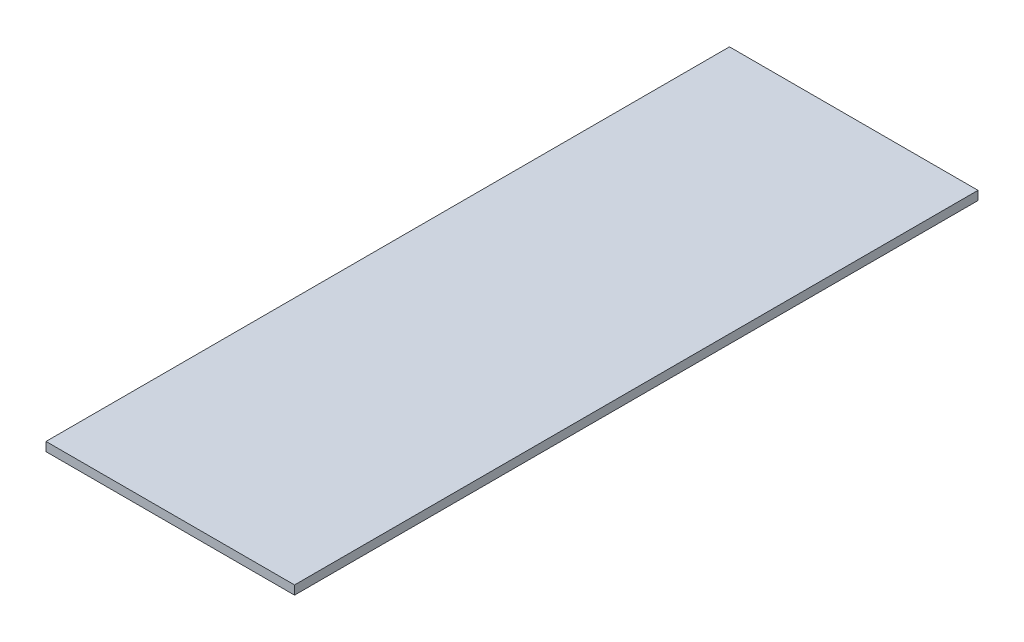
ISO-10303-21;
HEADER;
FILE_DESCRIPTION(('STEP AP214'),'2;1');
FILE_NAME('part.step','',(''),(''),'','','');
FILE_SCHEMA(('AUTOMOTIVE_DESIGN { 1 0 10303 214 1 1 1 1 }'));
ENDSEC;
DATA;
#1=APPLICATION_CONTEXT('core data for automotive mechanical design processes');
#2=APPLICATION_PROTOCOL_DEFINITION('international standard','automotive_design',2000,#1);
#3=PRODUCT_CONTEXT('',#1,'mechanical');
#4=PRODUCT('Part','Part','',(#3));
#5=PRODUCT_RELATED_PRODUCT_CATEGORY('part','',(#4));
#6=PRODUCT_DEFINITION_FORMATION('','',#4);
#7=PRODUCT_DEFINITION_CONTEXT('part definition',#1,'design');
#8=PRODUCT_DEFINITION('design','',#6,#7);
#9=PRODUCT_DEFINITION_SHAPE('','',#8);
#10=(LENGTH_UNIT() NAMED_UNIT(*) SI_UNIT(.MILLI.,.METRE.));
#11=(NAMED_UNIT(*) PLANE_ANGLE_UNIT() SI_UNIT($,.RADIAN.));
#12=(NAMED_UNIT(*) SI_UNIT($,.STERADIAN.) SOLID_ANGLE_UNIT());
#13=UNCERTAINTY_MEASURE_WITH_UNIT(LENGTH_MEASURE(1.E-05),#10,'distance_accuracy_value','');
#14=(GEOMETRIC_REPRESENTATION_CONTEXT(3) GLOBAL_UNCERTAINTY_ASSIGNED_CONTEXT((#13)) GLOBAL_UNIT_ASSIGNED_CONTEXT((#10,
#11,#12)) REPRESENTATION_CONTEXT('',''));
#15=CARTESIAN_POINT('',(0.,0.,0.));
#16=DIRECTION('',(0.,0.,1.));
#17=DIRECTION('',(1.,0.,0.));
#18=AXIS2_PLACEMENT_3D('',#15,#16,#17);
#19=CARTESIAN_POINT('',(-28.,2.,77.));
#20=DIRECTION('',(0.,0.,-1.));
#21=DIRECTION('',(-1.,0.,0.));
#22=AXIS2_PLACEMENT_3D('',#19,#20,#21);
#23=PLANE('',#22);
#24=DIRECTION('',(1.,0.,0.));
#25=VECTOR('',#24,1.);
#26=CARTESIAN_POINT('',(-28.,0.,77.));
#27=LINE('',#26,#25);
#28=CARTESIAN_POINT('',(-28.,0.,77.));
#29=VERTEX_POINT('',#28);
#30=CARTESIAN_POINT('',(28.,0.,77.));
#31=VERTEX_POINT('',#30);
#32=EDGE_CURVE('E98',#29,#31,#27,.T.);
#33=ORIENTED_EDGE('',*,*,#32,.T.);
#34=DIRECTION('',(0.,-1.,0.));
#35=VECTOR('',#34,1.);
#36=CARTESIAN_POINT('',(28.,2.,77.));
#37=LINE('',#36,#35);
#38=CARTESIAN_POINT('',(28.,2.,77.));
#39=VERTEX_POINT('',#38);
#40=EDGE_CURVE('E11',#39,#31,#37,.T.);
#41=ORIENTED_EDGE('',*,*,#40,.F.);
#42=DIRECTION('',(1.,0.,0.));
#43=VECTOR('',#42,1.);
#44=CARTESIAN_POINT('',(-28.,2.,77.));
#45=LINE('',#44,#43);
#46=CARTESIAN_POINT('',(-28.,2.,77.));
#47=VERTEX_POINT('',#46);
#48=EDGE_CURVE('E86',#47,#39,#45,.T.);
#49=ORIENTED_EDGE('',*,*,#48,.F.);
#50=DIRECTION('',(0.,-1.,0.));
#51=VECTOR('',#50,1.);
#52=CARTESIAN_POINT('',(-28.,2.,77.));
#53=LINE('',#52,#51);
#54=EDGE_CURVE('E94',#47,#29,#53,.T.);
#55=ORIENTED_EDGE('',*,*,#54,.T.);
#56=EDGE_LOOP('',(#33,#41,#49,#55));
#57=FACE_BOUND('',#56,.T.);
#58=ADVANCED_FACE('F35',(#57),#23,.F.);
#59=CARTESIAN_POINT('',(28.,2.,77.));
#60=DIRECTION('',(-1.,0.,0.));
#61=DIRECTION('',(0.,0.,1.));
#62=AXIS2_PLACEMENT_3D('',#59,#60,#61);
#63=PLANE('',#62);
#64=DIRECTION('',(0.,0.,-1.));
#65=VECTOR('',#64,1.);
#66=CARTESIAN_POINT('',(28.,0.,77.));
#67=LINE('',#66,#65);
#68=CARTESIAN_POINT('',(28.,0.,-77.));
#69=VERTEX_POINT('',#68);
#70=EDGE_CURVE('E90',#31,#69,#67,.T.);
#71=ORIENTED_EDGE('',*,*,#70,.T.);
#72=DIRECTION('',(0.,-1.,0.));
#73=VECTOR('',#72,1.);
#74=CARTESIAN_POINT('',(28.,2.,-77.));
#75=LINE('',#74,#73);
#76=CARTESIAN_POINT('',(28.,2.,-77.));
#77=VERTEX_POINT('',#76);
#78=EDGE_CURVE('E43',#77,#69,#75,.T.);
#79=ORIENTED_EDGE('',*,*,#78,.F.);
#80=DIRECTION('',(0.,0.,-1.));
#81=VECTOR('',#80,1.);
#82=CARTESIAN_POINT('',(28.,2.,77.));
#83=LINE('',#82,#81);
#84=EDGE_CURVE('E81',#39,#77,#83,.T.);
#85=ORIENTED_EDGE('',*,*,#84,.F.);
#86=ORIENTED_EDGE('',*,*,#40,.T.);
#87=EDGE_LOOP('',(#71,#79,#85,#86));
#88=FACE_BOUND('',#87,.T.);
#89=ADVANCED_FACE('F89',(#88),#63,.F.);
#90=CARTESIAN_POINT('',(-28.,2.,-77.));
#91=DIRECTION('',(0.,0.,1.));
#92=DIRECTION('',(1.,0.,0.));
#93=AXIS2_PLACEMENT_3D('',#90,#91,#92);
#94=PLANE('',#93);
#95=DIRECTION('',(-1.,0.,0.));
#96=VECTOR('',#95,1.);
#97=CARTESIAN_POINT('',(-28.,0.,-77.));
#98=LINE('',#97,#96);
#99=CARTESIAN_POINT('',(-28.,0.,-77.));
#100=VERTEX_POINT('',#99);
#101=EDGE_CURVE('E68',#69,#100,#98,.T.);
#102=ORIENTED_EDGE('',*,*,#101,.T.);
#103=DIRECTION('',(0.,-1.,0.));
#104=VECTOR('',#103,1.);
#105=CARTESIAN_POINT('',(-28.,2.,-77.));
#106=LINE('',#105,#104);
#107=CARTESIAN_POINT('',(-28.,2.,-77.));
#108=VERTEX_POINT('',#107);
#109=EDGE_CURVE('E91',#108,#100,#106,.T.);
#110=ORIENTED_EDGE('',*,*,#109,.F.);
#111=DIRECTION('',(-1.,0.,0.));
#112=VECTOR('',#111,1.);
#113=CARTESIAN_POINT('',(-28.,2.,-77.));
#114=LINE('',#113,#112);
#115=EDGE_CURVE('E84',#77,#108,#114,.T.);
#116=ORIENTED_EDGE('',*,*,#115,.F.);
#117=ORIENTED_EDGE('',*,*,#78,.T.);
#118=EDGE_LOOP('',(#102,#110,#116,#117));
#119=FACE_BOUND('',#118,.T.);
#120=ADVANCED_FACE('F92',(#119),#94,.F.);
#121=CARTESIAN_POINT('',(-28.,2.,77.));
#122=DIRECTION('',(1.,0.,0.));
#123=DIRECTION('',(0.,0.,-1.));
#124=AXIS2_PLACEMENT_3D('',#121,#122,#123);
#125=PLANE('',#124);
#126=DIRECTION('',(0.,0.,1.));
#127=VECTOR('',#126,1.);
#128=CARTESIAN_POINT('',(-28.,0.,77.));
#129=LINE('',#128,#127);
#130=EDGE_CURVE('E74',#100,#29,#129,.T.);
#131=ORIENTED_EDGE('',*,*,#130,.T.);
#132=ORIENTED_EDGE('',*,*,#54,.F.);
#133=DIRECTION('',(0.,0.,1.));
#134=VECTOR('',#133,1.);
#135=CARTESIAN_POINT('',(-28.,2.,77.));
#136=LINE('',#135,#134);
#137=EDGE_CURVE('E51',#108,#47,#136,.T.);
#138=ORIENTED_EDGE('',*,*,#137,.F.);
#139=ORIENTED_EDGE('',*,*,#109,.T.);
#140=EDGE_LOOP('',(#131,#132,#138,#139));
#141=FACE_BOUND('',#140,.T.);
#142=ADVANCED_FACE('F105',(#141),#125,.F.);
#143=CARTESIAN_POINT('',(0.,2.,0.));
#144=DIRECTION('',(0.,1.,0.));
#145=DIRECTION('',(0.,0.,1.));
#146=AXIS2_PLACEMENT_3D('',#143,#144,#145);
#147=PLANE('',#146);
#148=ORIENTED_EDGE('',*,*,#48,.T.);
#149=ORIENTED_EDGE('',*,*,#84,.T.);
#150=ORIENTED_EDGE('',*,*,#115,.T.);
#151=ORIENTED_EDGE('',*,*,#137,.T.);
#152=EDGE_LOOP('',(#148,#149,#150,#151));
#153=FACE_BOUND('',#152,.T.);
#154=ADVANCED_FACE('F82',(#153),#147,.T.);
#155=CARTESIAN_POINT('',(0.,0.,0.));
#156=DIRECTION('',(0.,1.,0.));
#157=DIRECTION('',(0.,0.,1.));
#158=AXIS2_PLACEMENT_3D('',#155,#156,#157);
#159=PLANE('',#158);
#160=ORIENTED_EDGE('',*,*,#32,.F.);
#161=ORIENTED_EDGE('',*,*,#130,.F.);
#162=ORIENTED_EDGE('',*,*,#101,.F.);
#163=ORIENTED_EDGE('',*,*,#70,.F.);
#164=EDGE_LOOP('',(#160,#161,#162,#163));
#165=FACE_BOUND('',#164,.T.);
#166=ADVANCED_FACE('F108',(#165),#159,.F.);
#167=CLOSED_SHELL('',(#58,#89,#120,#142,#154,#166));
#168=MANIFOLD_SOLID_BREP('B2',#167);
#169=ADVANCED_BREP_SHAPE_REPRESENTATION('',(#18,#168),#14);
#170=SHAPE_DEFINITION_REPRESENTATION(#9,#169);
ENDSEC;
END-ISO-10303-21;
